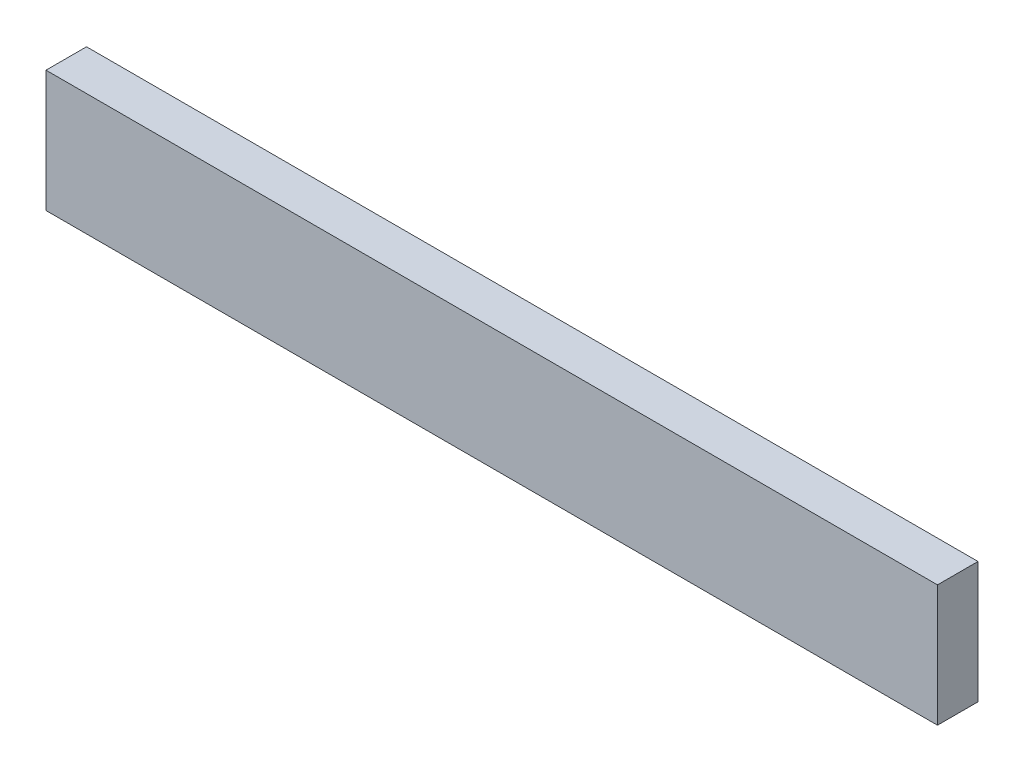
ISO-10303-21;
HEADER;
FILE_DESCRIPTION(('STEP AP214'),'2;1');
FILE_NAME('part.step','',(''),(''),'','','');
FILE_SCHEMA(('AUTOMOTIVE_DESIGN { 1 0 10303 214 1 1 1 1 }'));
ENDSEC;
DATA;
#1=APPLICATION_CONTEXT('core data for automotive mechanical design processes');
#2=APPLICATION_PROTOCOL_DEFINITION('international standard','automotive_design',2000,#1);
#3=PRODUCT_CONTEXT('',#1,'mechanical');
#4=PRODUCT('Part','Part','',(#3));
#5=PRODUCT_RELATED_PRODUCT_CATEGORY('part','',(#4));
#6=PRODUCT_DEFINITION_FORMATION('','',#4);
#7=PRODUCT_DEFINITION_CONTEXT('part definition',#1,'design');
#8=PRODUCT_DEFINITION('design','',#6,#7);
#9=PRODUCT_DEFINITION_SHAPE('','',#8);
#10=(LENGTH_UNIT() NAMED_UNIT(*) SI_UNIT(.MILLI.,.METRE.));
#11=(NAMED_UNIT(*) PLANE_ANGLE_UNIT() SI_UNIT($,.RADIAN.));
#12=(NAMED_UNIT(*) SI_UNIT($,.STERADIAN.) SOLID_ANGLE_UNIT());
#13=UNCERTAINTY_MEASURE_WITH_UNIT(LENGTH_MEASURE(1.E-05),#10,'distance_accuracy_value','');
#14=(GEOMETRIC_REPRESENTATION_CONTEXT(3) GLOBAL_UNCERTAINTY_ASSIGNED_CONTEXT((#13)) GLOBAL_UNIT_ASSIGNED_CONTEXT((#10,
#11,#12)) REPRESENTATION_CONTEXT('',''));
#15=CARTESIAN_POINT('',(0.,0.,0.));
#16=DIRECTION('',(0.,0.,1.));
#17=DIRECTION('',(1.,0.,0.));
#18=AXIS2_PLACEMENT_3D('',#15,#16,#17);
#19=CARTESIAN_POINT('',(-0.10999978,0.01500123999999,0.01));
#20=DIRECTION('',(0.,0.,-1.));
#21=DIRECTION('',(-1.,0.,0.));
#22=AXIS2_PLACEMENT_3D('',#19,#20,#21);
#23=PLANE('',#22);
#24=DIRECTION('',(1.,0.,0.));
#25=VECTOR('',#24,1.);
#26=CARTESIAN_POINT('',(-0.10999978,-0.01499870000001,0.01));
#27=LINE('',#26,#25);
#28=CARTESIAN_POINT('',(-0.10999978,-0.01499870000001,0.01));
#29=VERTEX_POINT('',#28);
#30=CARTESIAN_POINT('',(0.11000232,-0.01499870000001,0.01));
#31=VERTEX_POINT('',#30);
#32=EDGE_CURVE('E55',#29,#31,#27,.T.);
#33=ORIENTED_EDGE('',*,*,#32,.T.);
#34=DIRECTION('',(0.,1.,0.));
#35=VECTOR('',#34,1.);
#36=CARTESIAN_POINT('',(0.11000232,-0.01499870000001,0.01));
#37=LINE('',#36,#35);
#38=CARTESIAN_POINT('',(0.11000232,0.01500123999999,0.01));
#39=VERTEX_POINT('',#38);
#40=EDGE_CURVE('E57',#31,#39,#37,.T.);
#41=ORIENTED_EDGE('',*,*,#40,.T.);
#42=DIRECTION('',(1.,0.,0.));
#43=VECTOR('',#42,1.);
#44=CARTESIAN_POINT('',(0.11000232,0.01500123999999,0.01));
#45=LINE('',#44,#43);
#46=CARTESIAN_POINT('',(-0.10999978,0.01500123999999,0.01));
#47=VERTEX_POINT('',#46);
#48=EDGE_CURVE('E19',#39,#47,#45,.F.);
#49=ORIENTED_EDGE('',*,*,#48,.T.);
#50=DIRECTION('',(0.,1.,0.));
#51=VECTOR('',#50,1.);
#52=CARTESIAN_POINT('',(-0.10999978,0.01500123999999,0.01));
#53=LINE('',#52,#51);
#54=EDGE_CURVE('E90',#47,#29,#53,.F.);
#55=ORIENTED_EDGE('',*,*,#54,.T.);
#56=EDGE_LOOP('',(#33,#41,#49,#55));
#57=FACE_BOUND('',#56,.T.);
#58=ADVANCED_FACE('F16',(#57),#23,.F.);
#59=CARTESIAN_POINT('',(0.11000232,0.01500123999999,0.));
#60=DIRECTION('',(0.,-1.,0.));
#61=DIRECTION('',(0.,0.,-1.));
#62=AXIS2_PLACEMENT_3D('',#59,#60,#61);
#63=PLANE('',#62);
#64=DIRECTION('',(0.,0.,-1.));
#65=VECTOR('',#64,1.);
#66=CARTESIAN_POINT('',(-0.10999978,0.01500123999999,0.));
#67=LINE('',#66,#65);
#68=CARTESIAN_POINT('',(-0.10999978,0.01500123999999,0.));
#69=VERTEX_POINT('',#68);
#70=EDGE_CURVE('E69',#69,#47,#67,.F.);
#71=ORIENTED_EDGE('',*,*,#70,.T.);
#72=ORIENTED_EDGE('',*,*,#48,.F.);
#73=DIRECTION('',(0.,0.,1.));
#74=VECTOR('',#73,1.);
#75=CARTESIAN_POINT('',(0.11000232,0.01500123999999,0.));
#76=LINE('',#75,#74);
#77=CARTESIAN_POINT('',(0.11000232,0.01500123999999,0.));
#78=VERTEX_POINT('',#77);
#79=EDGE_CURVE('E64',#39,#78,#76,.F.);
#80=ORIENTED_EDGE('',*,*,#79,.T.);
#81=DIRECTION('',(-1.,0.,0.));
#82=VECTOR('',#81,1.);
#83=CARTESIAN_POINT('',(-0.10999978,0.01500123999999,0.));
#84=LINE('',#83,#82);
#85=EDGE_CURVE('E94',#69,#78,#84,.F.);
#86=ORIENTED_EDGE('',*,*,#85,.F.);
#87=EDGE_LOOP('',(#71,#72,#80,#86));
#88=FACE_BOUND('',#87,.T.);
#89=ADVANCED_FACE('F66',(#88),#63,.F.);
#90=CARTESIAN_POINT('',(0.11000232,-0.01499870000001,0.));
#91=DIRECTION('',(-1.,0.,0.));
#92=DIRECTION('',(0.,0.,1.));
#93=AXIS2_PLACEMENT_3D('',#90,#91,#92);
#94=PLANE('',#93);
#95=ORIENTED_EDGE('',*,*,#79,.F.);
#96=ORIENTED_EDGE('',*,*,#40,.F.);
#97=DIRECTION('',(0.,0.,1.));
#98=VECTOR('',#97,1.);
#99=CARTESIAN_POINT('',(0.11000232,-0.01499870000001,0.));
#100=LINE('',#99,#98);
#101=CARTESIAN_POINT('',(0.11000232,-0.01499870000001,0.));
#102=VERTEX_POINT('',#101);
#103=EDGE_CURVE('E83',#31,#102,#100,.F.);
#104=ORIENTED_EDGE('',*,*,#103,.T.);
#105=DIRECTION('',(0.,1.,0.));
#106=VECTOR('',#105,1.);
#107=CARTESIAN_POINT('',(0.11000232,0.01500123999999,0.));
#108=LINE('',#107,#106);
#109=EDGE_CURVE('E74',#78,#102,#108,.F.);
#110=ORIENTED_EDGE('',*,*,#109,.F.);
#111=EDGE_LOOP('',(#95,#96,#104,#110));
#112=FACE_BOUND('',#111,.T.);
#113=ADVANCED_FACE('F72',(#112),#94,.F.);
#114=CARTESIAN_POINT('',(-0.10999978,-0.01499870000001,0.));
#115=DIRECTION('',(0.,1.,0.));
#116=DIRECTION('',(0.,0.,1.));
#117=AXIS2_PLACEMENT_3D('',#114,#115,#116);
#118=PLANE('',#117);
#119=ORIENTED_EDGE('',*,*,#103,.F.);
#120=ORIENTED_EDGE('',*,*,#32,.F.);
#121=DIRECTION('',(0.,0.,-1.));
#122=VECTOR('',#121,1.);
#123=CARTESIAN_POINT('',(-0.10999978,-0.01499870000001,0.));
#124=LINE('',#123,#122);
#125=CARTESIAN_POINT('',(-0.10999978,-0.01499870000001,0.));
#126=VERTEX_POINT('',#125);
#127=EDGE_CURVE('E35',#29,#126,#124,.T.);
#128=ORIENTED_EDGE('',*,*,#127,.T.);
#129=DIRECTION('',(-1.,0.,0.));
#130=VECTOR('',#129,1.);
#131=CARTESIAN_POINT('',(-0.10999978,-0.01499870000001,0.));
#132=LINE('',#131,#130);
#133=EDGE_CURVE('E26',#102,#126,#132,.T.);
#134=ORIENTED_EDGE('',*,*,#133,.F.);
#135=EDGE_LOOP('',(#119,#120,#128,#134));
#136=FACE_BOUND('',#135,.T.);
#137=ADVANCED_FACE('F104',(#136),#118,.F.);
#138=CARTESIAN_POINT('',(-0.10999978,0.01500123999999,0.));
#139=DIRECTION('',(1.,0.,0.));
#140=DIRECTION('',(0.,0.,-1.));
#141=AXIS2_PLACEMENT_3D('',#138,#139,#140);
#142=PLANE('',#141);
#143=ORIENTED_EDGE('',*,*,#127,.F.);
#144=ORIENTED_EDGE('',*,*,#54,.F.);
#145=ORIENTED_EDGE('',*,*,#70,.F.);
#146=DIRECTION('',(0.,1.,0.));
#147=VECTOR('',#146,1.);
#148=CARTESIAN_POINT('',(-0.10999978,0.01500123999999,0.));
#149=LINE('',#148,#147);
#150=EDGE_CURVE('E11',#126,#69,#149,.T.);
#151=ORIENTED_EDGE('',*,*,#150,.F.);
#152=EDGE_LOOP('',(#143,#144,#145,#151));
#153=FACE_BOUND('',#152,.T.);
#154=ADVANCED_FACE('F106',(#153),#142,.F.);
#155=CARTESIAN_POINT('',(-0.10999978,0.01500123999999,0.));
#156=DIRECTION('',(0.,0.,-1.));
#157=DIRECTION('',(-1.,0.,0.));
#158=AXIS2_PLACEMENT_3D('',#155,#156,#157);
#159=PLANE('',#158);
#160=ORIENTED_EDGE('',*,*,#133,.T.);
#161=ORIENTED_EDGE('',*,*,#150,.T.);
#162=ORIENTED_EDGE('',*,*,#85,.T.);
#163=ORIENTED_EDGE('',*,*,#109,.T.);
#164=EDGE_LOOP('',(#160,#161,#162,#163));
#165=FACE_BOUND('',#164,.T.);
#166=ADVANCED_FACE('F103',(#165),#159,.T.);
#167=CLOSED_SHELL('',(#58,#89,#113,#137,#154,#166));
#168=MANIFOLD_SOLID_BREP('B1',#167);
#169=ADVANCED_BREP_SHAPE_REPRESENTATION('',(#18,#168),#14);
#170=SHAPE_DEFINITION_REPRESENTATION(#9,#169);
ENDSEC;
END-ISO-10303-21;
